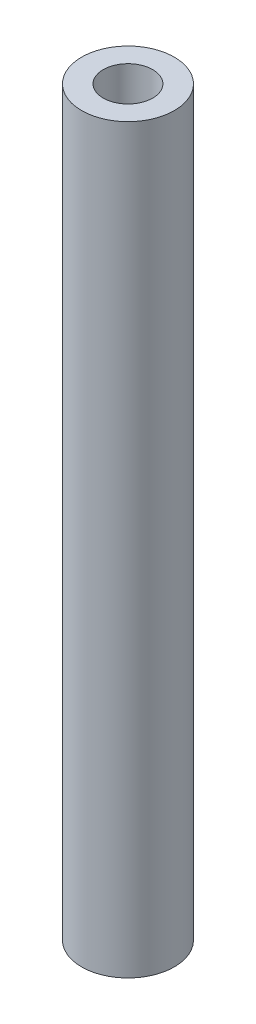
ISO-10303-21;
HEADER;
FILE_DESCRIPTION(('STEP AP214'),'2;1');
FILE_NAME('part.step','',(''),(''),'','','');
FILE_SCHEMA(('AUTOMOTIVE_DESIGN { 1 0 10303 214 1 1 1 1 }'));
ENDSEC;
DATA;
#1=APPLICATION_CONTEXT('core data for automotive mechanical design processes');
#2=APPLICATION_PROTOCOL_DEFINITION('international standard','automotive_design',2000,#1);
#3=PRODUCT_CONTEXT('',#1,'mechanical');
#4=PRODUCT('Part','Part','',(#3));
#5=PRODUCT_RELATED_PRODUCT_CATEGORY('part','',(#4));
#6=PRODUCT_DEFINITION_FORMATION('','',#4);
#7=PRODUCT_DEFINITION_CONTEXT('part definition',#1,'design');
#8=PRODUCT_DEFINITION('design','',#6,#7);
#9=PRODUCT_DEFINITION_SHAPE('','',#8);
#10=(LENGTH_UNIT() NAMED_UNIT(*) SI_UNIT(.MILLI.,.METRE.));
#11=(NAMED_UNIT(*) PLANE_ANGLE_UNIT() SI_UNIT($,.RADIAN.));
#12=(NAMED_UNIT(*) SI_UNIT($,.STERADIAN.) SOLID_ANGLE_UNIT());
#13=UNCERTAINTY_MEASURE_WITH_UNIT(LENGTH_MEASURE(1.E-05),#10,'distance_accuracy_value','');
#14=(GEOMETRIC_REPRESENTATION_CONTEXT(3) GLOBAL_UNCERTAINTY_ASSIGNED_CONTEXT((#13)) GLOBAL_UNIT_ASSIGNED_CONTEXT((#10,
#11,#12)) REPRESENTATION_CONTEXT('',''));
#15=CARTESIAN_POINT('',(0.,0.,0.));
#16=DIRECTION('',(0.,0.,1.));
#17=DIRECTION('',(1.,0.,0.));
#18=AXIS2_PLACEMENT_3D('',#15,#16,#17);
#19=CARTESIAN_POINT('',(0.,120.,0.));
#20=DIRECTION('',(0.,-1.,0.));
#21=DIRECTION('',(0.,0.,-1.));
#22=AXIS2_PLACEMENT_3D('',#19,#20,#21);
#23=CYLINDRICAL_SURFACE('',#22,7.5);
#24=CARTESIAN_POINT('',(0.,13.,-7.5));
#25=CARTESIAN_POINT('',(-0.080663200939535,12.9999983890229,-7.49999888970472));
#26=CARTESIAN_POINT('',(-0.161354413498372,12.99674011548,-7.4986936895007));
#27=CARTESIAN_POINT('',(-0.322146094522251,12.9837470954671,-7.49351186176526));
#28=CARTESIAN_POINT('',(-0.40224615798198,12.9740082625401,-7.48963361174618));
#29=CARTESIAN_POINT('',(-0.641096781067451,12.9351288598822,-7.47424634808757));
#30=CARTESIAN_POINT('',(-0.798158082521719,12.8963256924552,-7.45898522266242));
#31=CARTESIAN_POINT('',(-1.10247033899881,12.7946857721891,-7.42011459126984));
#32=CARTESIAN_POINT('',(-1.24975157753076,12.7319277009698,-7.39653243529675));
#33=CARTESIAN_POINT('',(-1.53159737405797,12.584471269705,-7.34334877224069));
#34=CARTESIAN_POINT('',(-1.66616632427491,12.4997805257342,-7.31374935540466));
#35=CARTESIAN_POINT('',(-1.92525452632722,12.3066467436976,-7.24996340359365));
#36=CARTESIAN_POINT('',(-2.04909421803168,12.1973400133687,-7.2156344837394));
#37=CARTESIAN_POINT('',(-2.27726169757605,11.9598999970569,-7.14690862377684));
#38=CARTESIAN_POINT('',(-2.38157993941975,11.8317575548035,-7.11251165865921));
#39=CARTESIAN_POINT('',(-2.5723120820679,11.5533578939878,-7.04584188546733));
#40=CARTESIAN_POINT('',(-2.65772253361337,11.4023702707912,-7.01373174174385));
#41=CARTESIAN_POINT('',(-2.80163201676496,11.0866954025439,-6.95750470553339));
#42=CARTESIAN_POINT('',(-2.86014383023324,10.9220147082749,-6.93338401809298));
#43=CARTESIAN_POINT('',(-2.94584825055477,10.5914314995665,-6.8973953654561));
#44=CARTESIAN_POINT('',(-2.974340952837,10.4259231466171,-6.88502130539265));
#45=CARTESIAN_POINT('',(-3.00325943833354,10.0920475025576,-6.87246006067861));
#46=CARTESIAN_POINT('',(-3.00369902341366,9.92368165809135,-6.87226688315068));
#47=CARTESIAN_POINT('',(-2.97748405223855,9.60136499277466,-6.88365750391268));
#48=CARTESIAN_POINT('',(-2.95271297167582,9.44722642827614,-6.89442262441714));
#49=CARTESIAN_POINT('',(-2.87992032013236,9.14551066588688,-6.92514281294202));
#50=CARTESIAN_POINT('',(-2.83189469212406,8.99793461781078,-6.94509948450628));
#51=CARTESIAN_POINT('',(-2.71304209891511,8.70997324573973,-6.99239227665172));
#52=CARTESIAN_POINT('',(-2.64176979349674,8.56979614142704,-7.0198706892988));
#53=CARTESIAN_POINT('',(-2.47875969107452,8.30287627544856,-7.07907174576134));
#54=CARTESIAN_POINT('',(-2.38701420764466,8.17613858589327,-7.11079598182861));
#55=CARTESIAN_POINT('',(-2.17732589918874,7.92938540679971,-7.17790105116005));
#56=CARTESIAN_POINT('',(-2.05790619445784,7.8106469058317,-7.21337497464925));
#57=CARTESIAN_POINT('',(-1.80047164114337,7.59447328299621,-7.28189737436726));
#58=CARTESIAN_POINT('',(-1.66245309800112,7.49704240388436,-7.31494536667799));
#59=CARTESIAN_POINT('',(-1.36811647890927,7.32457382887645,-7.37572021897015));
#60=CARTESIAN_POINT('',(-1.21149073701984,7.25001657820447,-7.40332905143173));
#61=CARTESIAN_POINT('',(-0.886535648224169,7.12874820838286,-7.44922242493087));
#62=CARTESIAN_POINT('',(-0.718212295274464,7.08202294366387,-7.4675117019356));
#63=CARTESIAN_POINT('',(-0.385343831411744,7.02032755687045,-7.49184209260378));
#64=CARTESIAN_POINT('',(-0.221164940978279,7.00364131861966,-7.49854418750274));
#65=CARTESIAN_POINT('',(0.107767964711732,6.99743034920708,-7.50102717765943));
#66=CARTESIAN_POINT('',(0.272521819835838,7.00789857767876,-7.49681090373437));
#67=CARTESIAN_POINT('',(0.590149108683056,7.05443762882797,-7.4783635059563));
#68=CARTESIAN_POINT('',(0.743223737663452,7.08933697052639,-7.46459087018283));
#69=CARTESIAN_POINT('',(1.04120314209096,7.1821535624648,-7.42889162108251));
#70=CARTESIAN_POINT('',(1.18610686533644,7.2400737695033,-7.40696396034803));
#71=CARTESIAN_POINT('',(1.46861817872593,7.37917740951964,-7.3562489215621));
#72=CARTESIAN_POINT('',(1.6058670341364,7.46101820806364,-7.32727223969676));
#73=CARTESIAN_POINT('',(1.86516538686656,7.64491048585956,-7.26560047118315));
#74=CARTESIAN_POINT('',(1.98720876112944,7.74697006438798,-7.23290389665512));
#75=CARTESIAN_POINT('',(2.22108456455632,7.97630501942013,-7.16467676457053));
#76=CARTESIAN_POINT('',(2.33171090075941,8.1048003122427,-7.12910162137139));
#77=CARTESIAN_POINT('',(2.53012679607027,8.37916012453069,-7.06112509376137));
#78=CARTESIAN_POINT('',(2.61791259181811,8.52502750057212,-7.02872423291408));
#79=CARTESIAN_POINT('',(2.76871125308744,8.83219254182838,-6.97071449859905));
#80=CARTESIAN_POINT('',(2.83147589251402,8.99362599858305,-6.94517446320966));
#81=CARTESIAN_POINT('',(2.92844432884616,9.326100477808,-6.90485510223108));
#82=CARTESIAN_POINT('',(2.96266920524752,9.49713430959661,-6.89006783567176));
#83=CARTESIAN_POINT('',(2.99957342838291,9.83069185184704,-6.87407638928378));
#84=CARTESIAN_POINT('',(3.00434563234764,9.99294225645078,-6.87197131434659));
#85=CARTESIAN_POINT('',(2.98770473002408,10.3158172895088,-6.87922254127235));
#86=CARTESIAN_POINT('',(2.96629494876878,10.4764421217941,-6.88857738776018));
#87=CARTESIAN_POINT('',(2.89960708102335,10.784998274275,-6.91689973341124));
#88=CARTESIAN_POINT('',(2.85530635681061,10.9331803731613,-6.93547246725061));
#89=CARTESIAN_POINT('',(2.7450080562502,11.2200679829191,-6.97986002865438));
#90=CARTESIAN_POINT('',(2.67900448789151,11.3587708638532,-7.00567685597584));
#91=CARTESIAN_POINT('',(2.52280960319953,11.6314142771862,-7.06347910401242));
#92=CARTESIAN_POINT('',(2.43144976133989,11.7646274239758,-7.09573308125317));
#93=CARTESIAN_POINT('',(2.22883641977581,12.014490557201,-7.16195721907533));
#94=CARTESIAN_POINT('',(2.1175769239766,12.1311355323133,-7.1959278947067));
#95=CARTESIAN_POINT('',(1.86976526416226,12.3523019648148,-7.26440289511609));
#96=CARTESIAN_POINT('',(1.73204093441049,12.455547059056,-7.29879901943986));
#97=CARTESIAN_POINT('',(1.43982353523661,12.6375144693551,-7.36200845178942));
#98=CARTESIAN_POINT('',(1.28532271229705,12.7162253809562,-7.39081916114845));
#99=CARTESIAN_POINT('',(1.04589046292377,12.8130735008888,-7.42714827886078));
#100=CARTESIAN_POINT('',(0.965550642326296,12.841655970124,-7.438042523706));
#101=CARTESIAN_POINT('',(0.802472015195126,12.8919376582943,-7.45739623794253));
#102=CARTESIAN_POINT('',(0.719734347003781,12.9136400868448,-7.46585684248286));
#103=CARTESIAN_POINT('',(0.552707555877388,12.9498820309638,-7.48007543500346));
#104=CARTESIAN_POINT('',(0.468422937872989,12.9644397091379,-7.48584027408325));
#105=CARTESIAN_POINT('',(0.29881460894124,12.9863036527915,-7.49452509406316));
#106=CARTESIAN_POINT('',(0.213491680311737,12.9936150722507,-7.49744709693401));
#107=CARTESIAN_POINT('',(0.0853730051866004,12.9990895204053,-7.49963590220856));
#108=CARTESIAN_POINT('',(0.0426904255930866,13.0000008525982,-7.50000058761588));
#109=CARTESIAN_POINT('',(0.,13.,-7.5));
#110=B_SPLINE_CURVE_WITH_KNOTS('',3,(#24,#25,#26,#27,#28,#29,#30,#31,#32,#33,#34,#35,#36,#37,
#38,#39,#40,#41,#42,#43,#44,#45,#46,#47,#48,#49,#50,#51,#52,#53,#54,#55,#56,#57,#58,#59,#60,#61,
#62,#63,#64,#65,#66,#67,#68,#69,#70,#71,#72,#73,#74,#75,#76,#77,#78,#79,#80,#81,#82,#83,#84,#85,
#86,#87,#88,#89,#90,#91,#92,#93,#94,#95,#96,#97,#98,#99,#100,#101,#102,#103,#104,#105,#106,#107,
#108,#109),.UNSPECIFIED.,.T.,.F.,(4,2,2,2,2,2,2,2,2,2,2,2,2,2,2,2,2,2,2,2,2,2,2,2,2,2,2,2,2,2,2,
2,2,2,2,2,2,2,2,2,2,2,4),(0.,0.241952995066614,0.48405870358986,0.968979675762157,
1.45232140795763,1.93549552527002,2.43941494725621,2.94358014576643,3.47018310403851,
3.99653556852428,4.49901580138268,5.00124881685757,5.46852914780512,5.93589103065598,
6.4127911162975,6.88987055088801,7.40382945961362,7.91789061441126,8.44210791925736,
8.96605856352212,9.45899198973538,9.9517976253665,10.4224610552807,10.8931849567222,
11.3783069227892,11.8636236142998,12.3809813411815,12.8984242574715,13.4208798989277,
13.9429493115043,14.4274493227065,14.911887810261,15.3771690000468,15.8425787588927,
16.3346362426656,16.8268422420412,17.3509605748228,17.8753221764233,18.1329380344125,
18.3904335342851,18.6472710222664,18.9039257004315,19.0319776028183),.UNSPECIFIED.);
#111=CARTESIAN_POINT('',(0.,13.,-7.5));
#112=VERTEX_POINT('',#111);
#113=EDGE_CURVE('E56',#112,#112,#110,.T.);
#114=ORIENTED_EDGE('',*,*,#113,.T.);
#115=EDGE_LOOP('',(#114));
#116=FACE_BOUND('',#115,.T.);
#117=CARTESIAN_POINT('',(0.,120.,0.));
#118=DIRECTION('',(0.,1.,0.));
#119=DIRECTION('',(0.,0.,1.));
#120=AXIS2_PLACEMENT_3D('',#117,#118,#119);
#121=CIRCLE('',#120,7.5);
#122=CARTESIAN_POINT('',(0.,120.,7.5));
#123=VERTEX_POINT('',#122);
#124=EDGE_CURVE('E10',#123,#123,#121,.T.);
#125=ORIENTED_EDGE('',*,*,#124,.F.);
#126=EDGE_LOOP('',(#125));
#127=FACE_BOUND('',#126,.T.);
#128=CARTESIAN_POINT('',(0.,0.,0.));
#129=DIRECTION('',(0.,1.,0.));
#130=DIRECTION('',(0.,0.,1.));
#131=AXIS2_PLACEMENT_3D('',#128,#129,#130);
#132=CIRCLE('',#131,7.5);
#133=CARTESIAN_POINT('',(0.,0.,7.5));
#134=VERTEX_POINT('',#133);
#135=EDGE_CURVE('E46',#134,#134,#132,.T.);
#136=ORIENTED_EDGE('',*,*,#135,.T.);
#137=EDGE_LOOP('',(#136));
#138=FACE_BOUND('',#137,.T.);
#139=ADVANCED_FACE('F33',(#116,#127,#138),#23,.T.);
#140=CARTESIAN_POINT('',(0.,120.,0.));
#141=DIRECTION('',(0.,1.,0.));
#142=DIRECTION('',(0.,0.,1.));
#143=AXIS2_PLACEMENT_3D('',#140,#141,#142);
#144=PLANE('',#143);
#145=CARTESIAN_POINT('',(0.,120.,0.));
#146=DIRECTION('',(0.,1.,0.));
#147=DIRECTION('',(0.,0.,1.));
#148=AXIS2_PLACEMENT_3D('',#145,#146,#147);
#149=CIRCLE('',#148,4.);
#150=CARTESIAN_POINT('',(0.,120.,4.));
#151=VERTEX_POINT('',#150);
#152=EDGE_CURVE('E64',#151,#151,#149,.T.);
#153=ORIENTED_EDGE('',*,*,#152,.F.);
#154=EDGE_LOOP('',(#153));
#155=FACE_BOUND('',#154,.T.);
#156=ORIENTED_EDGE('',*,*,#124,.T.);
#157=EDGE_LOOP('',(#156));
#158=FACE_BOUND('',#157,.T.);
#159=ADVANCED_FACE('F84',(#155,#158),#144,.T.);
#160=CARTESIAN_POINT('',(0.,0.,0.));
#161=DIRECTION('',(0.,1.,0.));
#162=DIRECTION('',(0.,0.,1.));
#163=AXIS2_PLACEMENT_3D('',#160,#161,#162);
#164=PLANE('',#163);
#165=CARTESIAN_POINT('',(0.,0.,0.));
#166=DIRECTION('',(0.,-1.,0.));
#167=DIRECTION('',(0.,0.,-1.));
#168=AXIS2_PLACEMENT_3D('',#165,#166,#167);
#169=CIRCLE('',#168,5.);
#170=CARTESIAN_POINT('',(0.,0.,-5.));
#171=VERTEX_POINT('',#170);
#172=EDGE_CURVE('E53',#171,#171,#169,.T.);
#173=ORIENTED_EDGE('',*,*,#172,.F.);
#174=EDGE_LOOP('',(#173));
#175=FACE_BOUND('',#174,.T.);
#176=ORIENTED_EDGE('',*,*,#135,.F.);
#177=EDGE_LOOP('',(#176));
#178=FACE_BOUND('',#177,.T.);
#179=ADVANCED_FACE('F82',(#175,#178),#164,.F.);
#180=CARTESIAN_POINT('',(0.,15.,0.));
#181=DIRECTION('',(0.,-1.,0.));
#182=DIRECTION('',(0.,0.,-1.));
#183=AXIS2_PLACEMENT_3D('',#180,#181,#182);
#184=CYLINDRICAL_SURFACE('',#183,5.);
#185=CARTESIAN_POINT('',(0.,13.,-5.));
#186=CARTESIAN_POINT('',(0.0767697294351706,12.9999989437555,-4.99999907546385));
#187=CARTESIAN_POINT('',(0.153562134518387,12.9970464064299,-4.99822567812271));
#188=CARTESIAN_POINT('',(0.306548487758715,12.9852857670203,-4.99118362570631));
#189=CARTESIAN_POINT('',(0.382742059346593,12.9764742388118,-4.98591292553957));
#190=CARTESIAN_POINT('',(0.609808130024627,12.9413514405369,-4.96499345352549));
#191=CARTESIAN_POINT('',(0.758981863291667,12.9063522975666,-4.94423772571335));
#192=CARTESIAN_POINT('',(1.04754167363585,12.8152272564959,-4.89123238995897));
#193=CARTESIAN_POINT('',(1.18697226741342,12.7592060779873,-4.8590397955111));
#194=CARTESIAN_POINT('',(1.45405042800218,12.628279339403,-4.7859070225578));
#195=CARTESIAN_POINT('',(1.58170090938261,12.5533784676398,-4.74496901614699));
#196=CARTESIAN_POINT('',(1.83260160381823,12.3804503448849,-4.65410731283371));
#197=CARTESIAN_POINT('',(1.95476885986166,12.2810926088335,-4.60373587041895));
#198=CARTESIAN_POINT('',(2.1817645874806,12.0650655928078,-4.50060875905921));
#199=CARTESIAN_POINT('',(2.28657046750404,11.9483741257817,-4.4478500955754));
#200=CARTESIAN_POINT('',(2.48890019509838,11.6841529788311,-4.33822134833335));
#201=CARTESIAN_POINT('',(2.5839553962784,11.5345964578778,-4.28164035635797));
#202=CARTESIAN_POINT('',(2.74722868670786,11.2183068536731,-4.17876602596121));
#203=CARTESIAN_POINT('',(2.81549033155811,11.0516022079669,-4.13245604474886));
#204=CARTESIAN_POINT('',(2.90881204577225,10.7468070983431,-4.06709259377223));
#205=CARTESIAN_POINT('',(2.94032394587637,10.6115280016386,-4.04415766338644));
#206=CARTESIAN_POINT('',(2.98432344587084,10.3363925694786,-4.01180616527621));
#207=CARTESIAN_POINT('',(2.99683469884359,10.196542146696,-4.00237279089367));
#208=CARTESIAN_POINT('',(3.0021101681982,9.91597700735215,-3.99841845126251));
#209=CARTESIAN_POINT('',(2.99483563630785,9.77526113408814,-4.00392674756739));
#210=CARTESIAN_POINT('',(2.96092124146106,9.49744246488215,-4.02906522155628));
#211=CARTESIAN_POINT('',(2.93426681225442,9.36034246705852,-4.04870602134772));
#212=CARTESIAN_POINT('',(2.86347831933194,9.09493945774947,-4.09906376582928));
#213=CARTESIAN_POINT('',(2.81957453422891,8.96654567700556,-4.12963433300037));
#214=CARTESIAN_POINT('',(2.71590167467072,8.71861023336821,-4.19854092703025));
#215=CARTESIAN_POINT('',(2.65612678414161,8.59907183617099,-4.23687979941459));
#216=CARTESIAN_POINT('',(2.51035773820672,8.35003086234367,-4.32510698365561));
#217=CARTESIAN_POINT('',(2.42160671901869,8.22244000763228,-4.37584263580749));
#218=CARTESIAN_POINT('',(2.22582963207778,7.9826508427799,-4.47861022524149));
#219=CARTESIAN_POINT('',(2.11878609335505,7.87046743459788,-4.53064336077653));
#220=CARTESIAN_POINT('',(1.87159040921359,7.64875774055152,-4.63871766962913));
#221=CARTESIAN_POINT('',(1.7289031517877,7.54178060876266,-4.69430681953072));
#222=CARTESIAN_POINT('',(1.5006105363028,7.40073128727715,-4.77018325995046));
#223=CARTESIAN_POINT('',(1.42209821815683,7.3569358644839,-4.79423315237467));
#224=CARTESIAN_POINT('',(1.26074368673915,7.27628117638901,-4.83916496756429));
#225=CARTESIAN_POINT('',(1.17790417501178,7.2394176479792,-4.86004883588962));
#226=CARTESIAN_POINT('',(1.01376371174003,7.17518855714337,-4.8968267274493));
#227=CARTESIAN_POINT('',(0.932690066663978,7.1473734395508,-4.91295100454953));
#228=CARTESIAN_POINT('',(0.767879949732847,7.09866604415477,-4.94139126794745));
#229=CARTESIAN_POINT('',(0.684144997174658,7.07776989155364,-4.95370938553284));
#230=CARTESIAN_POINT('',(0.514744462654445,7.04322814527525,-4.97416370514887));
#231=CARTESIAN_POINT('',(0.429080341969631,7.02957724417139,-4.98230296820872));
#232=CARTESIAN_POINT('',(0.256621746592227,7.0097338156098,-4.99415996414414));
#233=CARTESIAN_POINT('',(0.169827432617779,7.00354023914868,-4.99787831889699));
#234=CARTESIAN_POINT('',(-0.0673242571106238,6.99700732971638,-5.00179157954795));
#235=CARTESIAN_POINT('',(-0.218056842610643,7.0041884543694,-4.99746512571837));
#236=CARTESIAN_POINT('',(-0.515686907628979,7.0408455417291,-4.97557955020067));
#237=CARTESIAN_POINT('',(-0.662584464852948,7.07032105234186,-4.95802069684413));
#238=CARTESIAN_POINT('',(-0.945142599254797,7.14908845918427,-4.91189447655688));
#239=CARTESIAN_POINT('',(-1.08098954856942,7.19788112659201,-4.88360514429733));
#240=CARTESIAN_POINT('',(-1.34253345184751,7.3133543242009,-4.81827798628348));
#241=CARTESIAN_POINT('',(-1.46822839746274,7.38003838259407,-4.78123843515363));
#242=CARTESIAN_POINT('',(-1.72001192130149,7.53711409097797,-4.69690981059278));
#243=CARTESIAN_POINT('',(-1.8447881382422,7.62924769383747,-4.64895602406951));
#244=CARTESIAN_POINT('',(-2.0780522254822,7.83078275125475,-4.54948534225872));
#245=CARTESIAN_POINT('',(-2.18652085154154,7.9402042996027,-4.49796434043364));
#246=CARTESIAN_POINT('',(-2.39863988264156,8.18982079149315,-4.38890846835683));
#247=CARTESIAN_POINT('',(-2.4998203788417,8.33216777394303,-4.33146483230155));
#248=CARTESIAN_POINT('',(-2.67690479207534,8.63443204612755,-4.22432364395572));
#249=CARTESIAN_POINT('',(-2.7528353384546,8.79433058715124,-4.17461796061411));
#250=CARTESIAN_POINT('',(-2.86285157351705,9.09248604511071,-4.09969818429267));
#251=CARTESIAN_POINT('',(-2.90243250662612,9.22796062464203,-4.07151318633888));
#252=CARTESIAN_POINT('',(-2.96227327821696,9.50506415623522,-4.02819211510625));
#253=CARTESIAN_POINT('',(-2.98255990395066,9.64668428945151,-4.01303795327896));
#254=CARTESIAN_POINT('',(-3.00268261034205,9.9327538943952,-3.99800893189923));
#255=CARTESIAN_POINT('',(-3.00244179030844,10.0772119782483,-3.99819152744817));
#256=CARTESIAN_POINT('',(-2.98132945103105,10.3637888743464,-4.01395435932838));
#257=CARTESIAN_POINT('',(-2.9604467136959,10.5059063718748,-4.02954296823692));
#258=CARTESIAN_POINT('',(-2.90080351212232,10.7769768239951,-4.07266369966217));
#259=CARTESIAN_POINT('',(-2.86295284328648,10.9062341479243,-4.09958421715569));
#260=CARTESIAN_POINT('',(-2.77126473512031,11.1566745496531,-4.16211005816609));
#261=CARTESIAN_POINT('',(-2.7174212751772,11.277854565613,-4.19771865147484));
#262=CARTESIAN_POINT('',(-2.58578536859698,11.52863953946,-4.28025972950371));
#263=CARTESIAN_POINT('',(-2.50558518231556,11.6566815082148,-4.32809142579694));
#264=CARTESIAN_POINT('',(-2.32751213746957,11.8987608453066,-4.42640286674054));
#265=CARTESIAN_POINT('',(-2.22962472612067,12.0127865504795,-4.47688476749087));
#266=CARTESIAN_POINT('',(-2.00020353552556,12.2426988433295,-4.5845123827036));
#267=CARTESIAN_POINT('',(-1.86578571790514,12.3558498798616,-4.64140045738634));
#268=CARTESIAN_POINT('',(-1.57689277813436,12.5582079860481,-4.74731429537958));
#269=CARTESIAN_POINT('',(-1.42241049573676,12.6474064729197,-4.79633723789531));
#270=CARTESIAN_POINT('',(-1.18102189661686,12.7591244741905,-4.85920558314903));
#271=CARTESIAN_POINT('',(-1.10025014285136,12.7923359959645,-4.87817139185349));
#272=CARTESIAN_POINT('',(-0.935442217988395,12.8517721381435,-4.91243413775203));
#273=CARTESIAN_POINT('',(-0.85140798478811,12.8780008357009,-4.9277332153652));
#274=CARTESIAN_POINT('',(-0.681001816074575,12.9230094420757,-4.95415527987996));
#275=CARTESIAN_POINT('',(-0.594637500609301,12.9418110773033,-4.9652904423195));
#276=CARTESIAN_POINT('',(-0.42018374602077,12.971744355323,-4.98308318645253));
#277=CARTESIAN_POINT('',(-0.332095806784404,12.9828823861533,-4.98974449723791));
#278=CARTESIAN_POINT('',(-0.203123929661344,12.9933916838053,-4.99603728421477));
#279=CARTESIAN_POINT('',(-0.162556281113494,12.995868430454,-4.99752198179196));
#280=CARTESIAN_POINT('',(-0.0813278781867707,12.9991728969139,-4.99950360169341));
#281=CARTESIAN_POINT('',(-0.0406671206271733,13.0000005595229,-5.00000048975323));
#282=CARTESIAN_POINT('',(0.,13.,-5.));
#283=B_SPLINE_CURVE_WITH_KNOTS('',3,(#185,#186,#187,#188,#189,#190,#191,#192,#193,#194,#195,
#196,#197,#198,#199,#200,#201,#202,#203,#204,#205,#206,#207,#208,#209,#210,#211,#212,#213,#214,
#215,#216,#217,#218,#219,#220,#221,#222,#223,#224,#225,#226,#227,#228,#229,#230,#231,#232,#233,
#234,#235,#236,#237,#238,#239,#240,#241,#242,#243,#244,#245,#246,#247,#248,#249,#250,#251,#252,
#253,#254,#255,#256,#257,#258,#259,#260,#261,#262,#263,#264,#265,#266,#267,#268,#269,#270,#271,
#272,#273,#274,#275,#276,#277,#278,#279,#280,#281,#282),.UNSPECIFIED.,.T.,.F.,(4,2,2,2,2,2,2,2,
2,2,2,2,2,2,2,2,2,2,2,2,2,2,2,2,2,2,2,2,2,2,2,2,2,2,2,2,2,2,2,2,2,2,2,2,2,2,2,2,4),(0.,
0.230263300595003,0.4606613693334,0.922002149276126,1.38107466343612,1.84003329022065,
2.33408870888555,2.82878205293211,3.38413315803225,3.93857770807793,4.35913349134877,
4.77916531256766,5.20002031165062,5.62119195971354,6.03692224610023,6.45280509043346,
6.94139679873935,7.43045779030958,7.98767605192992,8.2665315714343,8.54521503013733,
8.80648473589063,9.06760787545942,9.3285394673096,9.58943435026958,10.0398406663534,
10.490237849174,10.9296843257003,11.3692175250854,11.8543559282721,12.3400624135416,
12.889063860465,13.437484464234,13.8674843581987,14.2968863865712,14.7278971274535,
15.1591422350194,15.5696105785277,15.9802336423656,16.4539008129506,16.927959499309,
17.4794148474152,18.0310675325446,18.2988384573895,18.5664526907294,18.8332781687618,
19.0998809626714,19.221853785686,19.3438308395353),.UNSPECIFIED.);
#284=CARTESIAN_POINT('',(0.,13.,-5.));
#285=VERTEX_POINT('',#284);
#286=EDGE_CURVE('E37',#285,#285,#283,.T.);
#287=ORIENTED_EDGE('',*,*,#286,.T.);
#288=EDGE_LOOP('',(#287));
#289=FACE_BOUND('',#288,.T.);
#290=CARTESIAN_POINT('',(0.,15.,0.));
#291=DIRECTION('',(0.,-1.,0.));
#292=DIRECTION('',(0.,0.,-1.));
#293=AXIS2_PLACEMENT_3D('',#290,#291,#292);
#294=CIRCLE('',#293,5.);
#295=CARTESIAN_POINT('',(0.,15.,-5.));
#296=VERTEX_POINT('',#295);
#297=EDGE_CURVE('E51',#296,#296,#294,.T.);
#298=ORIENTED_EDGE('',*,*,#297,.F.);
#299=EDGE_LOOP('',(#298));
#300=FACE_BOUND('',#299,.T.);
#301=ORIENTED_EDGE('',*,*,#172,.T.);
#302=EDGE_LOOP('',(#301));
#303=FACE_BOUND('',#302,.T.);
#304=ADVANCED_FACE('F77',(#289,#300,#303),#184,.F.);
#305=CARTESIAN_POINT('',(0.,15.,0.));
#306=DIRECTION('',(0.,-1.,0.));
#307=DIRECTION('',(0.,0.,-1.));
#308=AXIS2_PLACEMENT_3D('',#305,#306,#307);
#309=PLANE('',#308);
#310=ORIENTED_EDGE('',*,*,#297,.T.);
#311=EDGE_LOOP('',(#310));
#312=FACE_BOUND('',#311,.T.);
#313=ADVANCED_FACE('F72',(#312),#309,.T.);
#314=CARTESIAN_POINT('',(0.,10.,-10.));
#315=DIRECTION('',(0.,0.,1.));
#316=DIRECTION('',(1.,0.,0.));
#317=AXIS2_PLACEMENT_3D('',#314,#315,#316);
#318=CYLINDRICAL_SURFACE('',#317,3.);
#319=ORIENTED_EDGE('',*,*,#286,.F.);
#320=EDGE_LOOP('',(#319));
#321=FACE_BOUND('',#320,.T.);
#322=ORIENTED_EDGE('',*,*,#113,.F.);
#323=EDGE_LOOP('',(#322));
#324=FACE_BOUND('',#323,.T.);
#325=ADVANCED_FACE('F66',(#321,#324),#318,.F.);
#326=CARTESIAN_POINT('',(0.,108.,0.));
#327=DIRECTION('',(0.,1.,0.));
#328=DIRECTION('',(0.,0.,1.));
#329=AXIS2_PLACEMENT_3D('',#326,#327,#328);
#330=CYLINDRICAL_SURFACE('',#329,4.);
#331=CARTESIAN_POINT('',(0.,108.,0.));
#332=DIRECTION('',(0.,1.,0.));
#333=DIRECTION('',(0.,0.,1.));
#334=AXIS2_PLACEMENT_3D('',#331,#332,#333);
#335=CIRCLE('',#334,4.);
#336=CARTESIAN_POINT('',(0.,108.,4.));
#337=VERTEX_POINT('',#336);
#338=EDGE_CURVE('E135',#337,#337,#335,.T.);
#339=ORIENTED_EDGE('',*,*,#338,.F.);
#340=EDGE_LOOP('',(#339));
#341=FACE_BOUND('',#340,.T.);
#342=ORIENTED_EDGE('',*,*,#152,.T.);
#343=EDGE_LOOP('',(#342));
#344=FACE_BOUND('',#343,.T.);
#345=ADVANCED_FACE('F71',(#341,#344),#330,.F.);
#346=CARTESIAN_POINT('',(0.,108.,0.));
#347=DIRECTION('',(0.,1.,0.));
#348=DIRECTION('',(0.,0.,1.));
#349=AXIS2_PLACEMENT_3D('',#346,#347,#348);
#350=PLANE('',#349);
#351=ORIENTED_EDGE('',*,*,#338,.T.);
#352=EDGE_LOOP('',(#351));
#353=FACE_BOUND('',#352,.T.);
#354=ADVANCED_FACE('F121',(#353),#350,.T.);
#355=CLOSED_SHELL('',(#139,#159,#179,#304,#313,#325,#345,#354));
#356=MANIFOLD_SOLID_BREP('B2',#355);
#357=ADVANCED_BREP_SHAPE_REPRESENTATION('',(#18,#356),#14);
#358=SHAPE_DEFINITION_REPRESENTATION(#9,#357);
ENDSEC;
END-ISO-10303-21;
